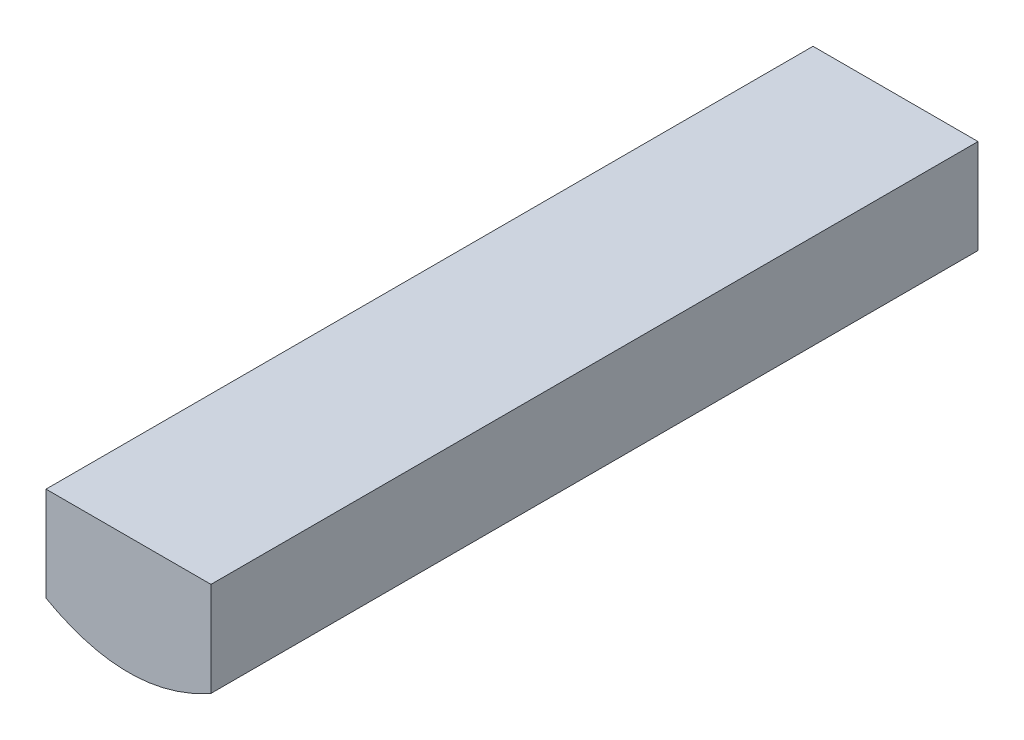
ISO-10303-21;
HEADER;
FILE_DESCRIPTION(('STEP AP214'),'2;1');
FILE_NAME('part.step','',(''),(''),'','','');
FILE_SCHEMA(('AUTOMOTIVE_DESIGN { 1 0 10303 214 1 1 1 1 }'));
ENDSEC;
DATA;
#1=APPLICATION_CONTEXT('core data for automotive mechanical design processes');
#2=APPLICATION_PROTOCOL_DEFINITION('international standard','automotive_design',2000,#1);
#3=PRODUCT_CONTEXT('',#1,'mechanical');
#4=PRODUCT('Part','Part','',(#3));
#5=PRODUCT_RELATED_PRODUCT_CATEGORY('part','',(#4));
#6=PRODUCT_DEFINITION_FORMATION('','',#4);
#7=PRODUCT_DEFINITION_CONTEXT('part definition',#1,'design');
#8=PRODUCT_DEFINITION('design','',#6,#7);
#9=PRODUCT_DEFINITION_SHAPE('','',#8);
#10=(LENGTH_UNIT() NAMED_UNIT(*) SI_UNIT(.MILLI.,.METRE.));
#11=(NAMED_UNIT(*) PLANE_ANGLE_UNIT() SI_UNIT($,.RADIAN.));
#12=(NAMED_UNIT(*) SI_UNIT($,.STERADIAN.) SOLID_ANGLE_UNIT());
#13=UNCERTAINTY_MEASURE_WITH_UNIT(LENGTH_MEASURE(1.E-05),#10,'distance_accuracy_value','');
#14=(GEOMETRIC_REPRESENTATION_CONTEXT(3) GLOBAL_UNCERTAINTY_ASSIGNED_CONTEXT((#13)) GLOBAL_UNIT_ASSIGNED_CONTEXT((#10,
#11,#12)) REPRESENTATION_CONTEXT('',''));
#15=CARTESIAN_POINT('',(0.,0.,0.));
#16=DIRECTION('',(0.,0.,1.));
#17=DIRECTION('',(1.,0.,0.));
#18=AXIS2_PLACEMENT_3D('',#15,#16,#17);
#19=CARTESIAN_POINT('',(-127.000000000214,127.000000000428,331.382));
#20=CARTESIAN_POINT('',(-3.79340656109228E-11,-127.000000000353,331.382));
#21=CARTESIAN_POINT('',(127.000000000138,127.000000000277,331.382));
#22=B_SPLINE_CURVE_WITH_KNOTS('',2,(#19,#20,#21),.UNSPECIFIED.,.F.,.F.,(3,3),
(0.0560283962320779,0.943971603767657),.UNSPECIFIED.);
#23=DIRECTION('',(0.,0.,-1.));
#24=VECTOR('',#23,1.);
#25=SURFACE_OF_LINEAR_EXTRUSION('',#22,#24);
#26=CARTESIAN_POINT('',(-35.6370593624671,9.99999999999999,331.382));
#27=VERTEX_POINT('',#26);
#28=CARTESIAN_POINT('',(35.6370593624671,9.99999999999999,331.382));
#29=VERTEX_POINT('',#28);
#30=EDGE_CURVE('E11',#27,#29,#22,.T.);
#31=ORIENTED_EDGE('',*,*,#30,.F.);
#32=DIRECTION('',(0.,0.,-1.));
#33=VECTOR('',#32,1.);
#34=CARTESIAN_POINT('',(-35.6370593624108,9.99999999999994,331.382));
#35=LINE('',#34,#33);
#36=CARTESIAN_POINT('',(-35.6370593624671,9.99999999999999,0.));
#37=VERTEX_POINT('',#36);
#38=EDGE_CURVE('E52',#27,#37,#35,.T.);
#39=ORIENTED_EDGE('',*,*,#38,.T.);
#40=CARTESIAN_POINT('',(-127.000000000214,127.000000000428,0.));
#41=CARTESIAN_POINT('',(-3.79340656109228E-11,-127.000000000353,0.));
#42=CARTESIAN_POINT('',(127.000000000138,127.000000000277,0.));
#43=B_SPLINE_CURVE_WITH_KNOTS('',2,(#40,#41,#42),.UNSPECIFIED.,.F.,.F.,(3,3),
(0.0560283962320779,0.943971603767657),.UNSPECIFIED.);
#44=CARTESIAN_POINT('',(35.6370593624671,10.0000000000315,0.));
#45=VERTEX_POINT('',#44);
#46=EDGE_CURVE('E36',#37,#45,#43,.T.);
#47=ORIENTED_EDGE('',*,*,#46,.T.);
#48=DIRECTION('',(0.,0.,-1.));
#49=VECTOR('',#48,1.);
#50=CARTESIAN_POINT('',(35.6370593624109,9.99999999999998,331.382));
#51=LINE('',#50,#49);
#52=EDGE_CURVE('E86',#45,#29,#51,.F.);
#53=ORIENTED_EDGE('',*,*,#52,.T.);
#54=EDGE_LOOP('',(#31,#39,#47,#53));
#55=FACE_BOUND('',#54,.T.);
#56=ADVANCED_FACE('F32',(#55),#25,.F.);
#57=CARTESIAN_POINT('',(-3.79349329726608E-11,0.,331.382));
#58=DIRECTION('',(0.,0.,-1.));
#59=DIRECTION('',(-1.,0.,0.));
#60=AXIS2_PLACEMENT_3D('',#57,#58,#59);
#61=PLANE('',#60);
#62=ORIENTED_EDGE('',*,*,#30,.T.);
#63=DIRECTION('',(0.,1.,0.));
#64=VECTOR('',#63,1.);
#65=CARTESIAN_POINT('',(35.6370593624671,9.99999999999999,331.382));
#66=LINE('',#65,#64);
#67=CARTESIAN_POINT('',(35.6370593624671,50.8,331.382));
#68=VERTEX_POINT('',#67);
#69=EDGE_CURVE('E99',#29,#68,#66,.T.);
#70=ORIENTED_EDGE('',*,*,#69,.T.);
#71=DIRECTION('',(-1.,0.,0.));
#72=VECTOR('',#71,1.);
#73=CARTESIAN_POINT('',(-35.6370593624671,50.8,331.382));
#74=LINE('',#73,#72);
#75=CARTESIAN_POINT('',(-35.6370593624671,50.8,331.382));
#76=VERTEX_POINT('',#75);
#77=EDGE_CURVE('E77',#68,#76,#74,.T.);
#78=ORIENTED_EDGE('',*,*,#77,.T.);
#79=DIRECTION('',(0.,-1.,0.));
#80=VECTOR('',#79,1.);
#81=CARTESIAN_POINT('',(-35.6370593624671,9.99999999999999,331.382));
#82=LINE('',#81,#80);
#83=EDGE_CURVE('E96',#76,#27,#82,.T.);
#84=ORIENTED_EDGE('',*,*,#83,.T.);
#85=EDGE_LOOP('',(#62,#70,#78,#84));
#86=FACE_BOUND('',#85,.T.);
#87=ADVANCED_FACE('F111',(#86),#61,.F.);
#88=CARTESIAN_POINT('',(-3.79349329726608E-11,0.,0.));
#89=DIRECTION('',(0.,0.,-1.));
#90=DIRECTION('',(-1.,0.,0.));
#91=AXIS2_PLACEMENT_3D('',#88,#89,#90);
#92=PLANE('',#91);
#93=ORIENTED_EDGE('',*,*,#46,.F.);
#94=DIRECTION('',(0.,-1.,0.));
#95=VECTOR('',#94,1.);
#96=CARTESIAN_POINT('',(-35.6370593624671,9.99999999999999,0.));
#97=LINE('',#96,#95);
#98=CARTESIAN_POINT('',(-35.6370593624671,50.8,0.));
#99=VERTEX_POINT('',#98);
#100=EDGE_CURVE('E88',#99,#37,#97,.T.);
#101=ORIENTED_EDGE('',*,*,#100,.F.);
#102=DIRECTION('',(-1.,0.,0.));
#103=VECTOR('',#102,1.);
#104=CARTESIAN_POINT('',(-35.6370593624671,50.8,0.));
#105=LINE('',#104,#103);
#106=CARTESIAN_POINT('',(35.6370593624671,50.8,0.));
#107=VERTEX_POINT('',#106);
#108=EDGE_CURVE('E75',#107,#99,#105,.T.);
#109=ORIENTED_EDGE('',*,*,#108,.F.);
#110=DIRECTION('',(0.,1.,0.));
#111=VECTOR('',#110,1.);
#112=CARTESIAN_POINT('',(35.6370593624671,9.99999999999999,0.));
#113=LINE('',#112,#111);
#114=EDGE_CURVE('E84',#45,#107,#113,.T.);
#115=ORIENTED_EDGE('',*,*,#114,.F.);
#116=EDGE_LOOP('',(#93,#101,#109,#115));
#117=FACE_BOUND('',#116,.T.);
#118=ADVANCED_FACE('F91',(#117),#92,.T.);
#119=CARTESIAN_POINT('',(-35.6370593624671,9.99999999999999,0.));
#120=DIRECTION('',(-1.,0.,0.));
#121=DIRECTION('',(0.,0.,1.));
#122=AXIS2_PLACEMENT_3D('',#119,#120,#121);
#123=PLANE('',#122);
#124=ORIENTED_EDGE('',*,*,#83,.F.);
#125=DIRECTION('',(0.,0.,1.));
#126=VECTOR('',#125,1.);
#127=CARTESIAN_POINT('',(-35.6370593624671,50.8,0.));
#128=LINE('',#127,#126);
#129=EDGE_CURVE('E81',#99,#76,#128,.T.);
#130=ORIENTED_EDGE('',*,*,#129,.F.);
#131=ORIENTED_EDGE('',*,*,#100,.T.);
#132=ORIENTED_EDGE('',*,*,#38,.F.);
#133=EDGE_LOOP('',(#124,#130,#131,#132));
#134=FACE_BOUND('',#133,.T.);
#135=ADVANCED_FACE('F114',(#134),#123,.T.);
#136=CARTESIAN_POINT('',(-35.6370593624671,50.8,0.));
#137=DIRECTION('',(0.,1.,0.));
#138=DIRECTION('',(0.,0.,1.));
#139=AXIS2_PLACEMENT_3D('',#136,#137,#138);
#140=PLANE('',#139);
#141=ORIENTED_EDGE('',*,*,#77,.F.);
#142=DIRECTION('',(0.,0.,1.));
#143=VECTOR('',#142,1.);
#144=CARTESIAN_POINT('',(35.6370593624671,50.8,0.));
#145=LINE('',#144,#143);
#146=EDGE_CURVE('E71',#107,#68,#145,.T.);
#147=ORIENTED_EDGE('',*,*,#146,.F.);
#148=ORIENTED_EDGE('',*,*,#108,.T.);
#149=ORIENTED_EDGE('',*,*,#129,.T.);
#150=EDGE_LOOP('',(#141,#147,#148,#149));
#151=FACE_BOUND('',#150,.T.);
#152=ADVANCED_FACE('F73',(#151),#140,.T.);
#153=CARTESIAN_POINT('',(35.6370593624671,9.99999999999999,0.));
#154=DIRECTION('',(1.,0.,0.));
#155=DIRECTION('',(0.,0.,-1.));
#156=AXIS2_PLACEMENT_3D('',#153,#154,#155);
#157=PLANE('',#156);
#158=ORIENTED_EDGE('',*,*,#69,.F.);
#159=ORIENTED_EDGE('',*,*,#52,.F.);
#160=ORIENTED_EDGE('',*,*,#114,.T.);
#161=ORIENTED_EDGE('',*,*,#146,.T.);
#162=EDGE_LOOP('',(#158,#159,#160,#161));
#163=FACE_BOUND('',#162,.T.);
#164=ADVANCED_FACE('F85',(#163),#157,.T.);
#165=CLOSED_SHELL('',(#56,#87,#118,#135,#152,#164));
#166=MANIFOLD_SOLID_BREP('B2',#165);
#167=ADVANCED_BREP_SHAPE_REPRESENTATION('',(#18,#166),#14);
#168=SHAPE_DEFINITION_REPRESENTATION(#9,#167);
ENDSEC;
END-ISO-10303-21;
